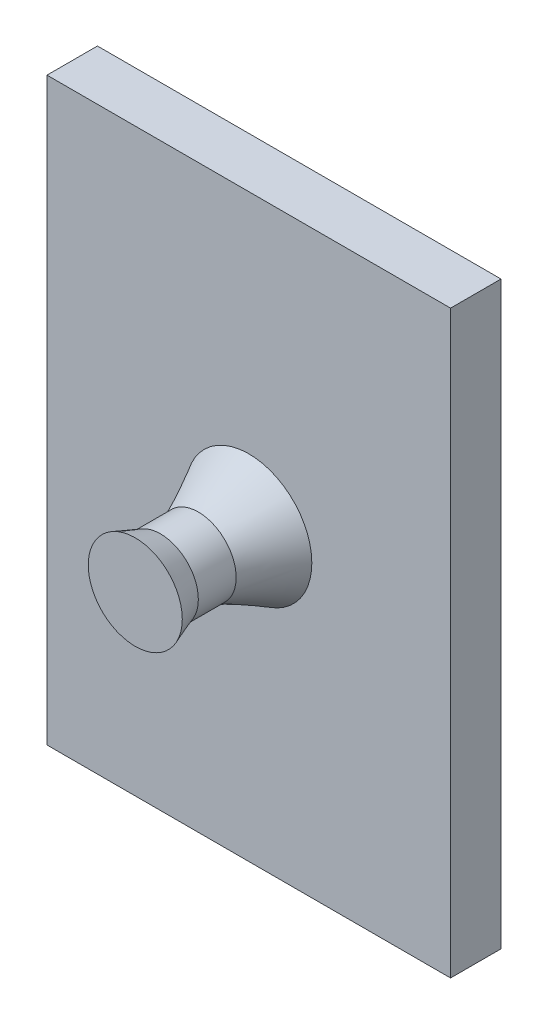
ISO-10303-21;
HEADER;
FILE_DESCRIPTION(('STEP AP214'),'2;1');
FILE_NAME('part.step','',(''),(''),'','','');
FILE_SCHEMA(('AUTOMOTIVE_DESIGN { 1 0 10303 214 1 1 1 1 }'));
ENDSEC;
DATA;
#1=APPLICATION_CONTEXT('core data for automotive mechanical design processes');
#2=APPLICATION_PROTOCOL_DEFINITION('international standard','automotive_design',2000,#1);
#3=PRODUCT_CONTEXT('',#1,'mechanical');
#4=PRODUCT('Part','Part','',(#3));
#5=PRODUCT_RELATED_PRODUCT_CATEGORY('part','',(#4));
#6=PRODUCT_DEFINITION_FORMATION('','',#4);
#7=PRODUCT_DEFINITION_CONTEXT('part definition',#1,'design');
#8=PRODUCT_DEFINITION('design','',#6,#7);
#9=PRODUCT_DEFINITION_SHAPE('','',#8);
#10=(LENGTH_UNIT() NAMED_UNIT(*) SI_UNIT(.MILLI.,.METRE.));
#11=(NAMED_UNIT(*) PLANE_ANGLE_UNIT() SI_UNIT($,.RADIAN.));
#12=(NAMED_UNIT(*) SI_UNIT($,.STERADIAN.) SOLID_ANGLE_UNIT());
#13=UNCERTAINTY_MEASURE_WITH_UNIT(LENGTH_MEASURE(1.E-05),#10,'distance_accuracy_value','');
#14=(GEOMETRIC_REPRESENTATION_CONTEXT(3) GLOBAL_UNCERTAINTY_ASSIGNED_CONTEXT((#13)) GLOBAL_UNIT_ASSIGNED_CONTEXT((#10,
#11,#12)) REPRESENTATION_CONTEXT('',''));
#15=CARTESIAN_POINT('',(0.,0.,0.));
#16=DIRECTION('',(0.,0.,1.));
#17=DIRECTION('',(1.,0.,0.));
#18=AXIS2_PLACEMENT_3D('',#15,#16,#17);
#19=CARTESIAN_POINT('',(0.,0.,2.));
#20=DIRECTION('',(1.,0.,0.));
#21=DIRECTION('',(0.,0.,-1.));
#22=AXIS2_PLACEMENT_3D('',#19,#20,#21);
#23=PLANE('',#22);
#24=DIRECTION('',(0.,-1.,0.));
#25=VECTOR('',#24,1.);
#26=CARTESIAN_POINT('',(0.,0.,0.));
#27=LINE('',#26,#25);
#28=CARTESIAN_POINT('',(0.,23.,0.));
#29=VERTEX_POINT('',#28);
#30=CARTESIAN_POINT('',(0.,0.,0.));
#31=VERTEX_POINT('',#30);
#32=EDGE_CURVE('E119',#29,#31,#27,.T.);
#33=ORIENTED_EDGE('',*,*,#32,.T.);
#34=DIRECTION('',(0.,0.,-1.));
#35=VECTOR('',#34,1.);
#36=CARTESIAN_POINT('',(0.,0.,2.));
#37=LINE('',#36,#35);
#38=CARTESIAN_POINT('',(0.,0.,2.));
#39=VERTEX_POINT('',#38);
#40=EDGE_CURVE('E12',#39,#31,#37,.T.);
#41=ORIENTED_EDGE('',*,*,#40,.F.);
#42=DIRECTION('',(0.,-1.,0.));
#43=VECTOR('',#42,1.);
#44=CARTESIAN_POINT('',(0.,0.,2.));
#45=LINE('',#44,#43);
#46=CARTESIAN_POINT('',(0.,23.,2.));
#47=VERTEX_POINT('',#46);
#48=EDGE_CURVE('E102',#47,#39,#45,.T.);
#49=ORIENTED_EDGE('',*,*,#48,.F.);
#50=DIRECTION('',(0.,0.,-1.));
#51=VECTOR('',#50,1.);
#52=CARTESIAN_POINT('',(0.,23.,2.));
#53=LINE('',#52,#51);
#54=EDGE_CURVE('E115',#47,#29,#53,.T.);
#55=ORIENTED_EDGE('',*,*,#54,.T.);
#56=EDGE_LOOP('',(#33,#41,#49,#55));
#57=FACE_BOUND('',#56,.T.);
#58=ADVANCED_FACE('F47',(#57),#23,.F.);
#59=CARTESIAN_POINT('',(0.,0.,2.));
#60=DIRECTION('',(0.,1.,0.));
#61=DIRECTION('',(0.,0.,1.));
#62=AXIS2_PLACEMENT_3D('',#59,#60,#61);
#63=PLANE('',#62);
#64=DIRECTION('',(1.,0.,0.));
#65=VECTOR('',#64,1.);
#66=CARTESIAN_POINT('',(0.,0.,0.));
#67=LINE('',#66,#65);
#68=CARTESIAN_POINT('',(16.,0.,0.));
#69=VERTEX_POINT('',#68);
#70=EDGE_CURVE('E107',#31,#69,#67,.T.);
#71=ORIENTED_EDGE('',*,*,#70,.T.);
#72=DIRECTION('',(0.,0.,-1.));
#73=VECTOR('',#72,1.);
#74=CARTESIAN_POINT('',(16.,0.,2.));
#75=LINE('',#74,#73);
#76=CARTESIAN_POINT('',(16.,0.,2.));
#77=VERTEX_POINT('',#76);
#78=EDGE_CURVE('E58',#77,#69,#75,.T.);
#79=ORIENTED_EDGE('',*,*,#78,.F.);
#80=DIRECTION('',(1.,0.,0.));
#81=VECTOR('',#80,1.);
#82=CARTESIAN_POINT('',(0.,0.,2.));
#83=LINE('',#82,#81);
#84=EDGE_CURVE('E97',#39,#77,#83,.T.);
#85=ORIENTED_EDGE('',*,*,#84,.F.);
#86=ORIENTED_EDGE('',*,*,#40,.T.);
#87=EDGE_LOOP('',(#71,#79,#85,#86));
#88=FACE_BOUND('',#87,.T.);
#89=ADVANCED_FACE('F106',(#88),#63,.F.);
#90=CARTESIAN_POINT('',(16.,0.,2.));
#91=DIRECTION('',(-1.,0.,0.));
#92=DIRECTION('',(0.,0.,1.));
#93=AXIS2_PLACEMENT_3D('',#90,#91,#92);
#94=PLANE('',#93);
#95=DIRECTION('',(0.,1.,0.));
#96=VECTOR('',#95,1.);
#97=CARTESIAN_POINT('',(16.,0.,0.));
#98=LINE('',#97,#96);
#99=CARTESIAN_POINT('',(16.,23.,0.));
#100=VERTEX_POINT('',#99);
#101=EDGE_CURVE('E84',#69,#100,#98,.T.);
#102=ORIENTED_EDGE('',*,*,#101,.T.);
#103=DIRECTION('',(0.,0.,-1.));
#104=VECTOR('',#103,1.);
#105=CARTESIAN_POINT('',(16.,23.,2.));
#106=LINE('',#105,#104);
#107=CARTESIAN_POINT('',(16.,23.,2.));
#108=VERTEX_POINT('',#107);
#109=EDGE_CURVE('E109',#108,#100,#106,.T.);
#110=ORIENTED_EDGE('',*,*,#109,.F.);
#111=DIRECTION('',(0.,1.,0.));
#112=VECTOR('',#111,1.);
#113=CARTESIAN_POINT('',(16.,0.,2.));
#114=LINE('',#113,#112);
#115=EDGE_CURVE('E100',#77,#108,#114,.T.);
#116=ORIENTED_EDGE('',*,*,#115,.F.);
#117=ORIENTED_EDGE('',*,*,#78,.T.);
#118=EDGE_LOOP('',(#102,#110,#116,#117));
#119=FACE_BOUND('',#118,.T.);
#120=ADVANCED_FACE('F111',(#119),#94,.F.);
#121=CARTESIAN_POINT('',(0.,23.,2.));
#122=DIRECTION('',(0.,-1.,0.));
#123=DIRECTION('',(0.,0.,-1.));
#124=AXIS2_PLACEMENT_3D('',#121,#122,#123);
#125=PLANE('',#124);
#126=DIRECTION('',(-1.,0.,0.));
#127=VECTOR('',#126,1.);
#128=CARTESIAN_POINT('',(0.,23.,0.));
#129=LINE('',#128,#127);
#130=EDGE_CURVE('E90',#100,#29,#129,.T.);
#131=ORIENTED_EDGE('',*,*,#130,.T.);
#132=ORIENTED_EDGE('',*,*,#54,.F.);
#133=DIRECTION('',(-1.,0.,0.));
#134=VECTOR('',#133,1.);
#135=CARTESIAN_POINT('',(0.,23.,2.));
#136=LINE('',#135,#134);
#137=EDGE_CURVE('E67',#108,#47,#136,.T.);
#138=ORIENTED_EDGE('',*,*,#137,.F.);
#139=ORIENTED_EDGE('',*,*,#109,.T.);
#140=EDGE_LOOP('',(#131,#132,#138,#139));
#141=FACE_BOUND('',#140,.T.);
#142=ADVANCED_FACE('F211',(#141),#125,.F.);
#143=CARTESIAN_POINT('',(0.,0.,2.));
#144=DIRECTION('',(0.,0.,-1.));
#145=DIRECTION('',(-1.,0.,0.));
#146=AXIS2_PLACEMENT_3D('',#143,#144,#145);
#147=PLANE('',#146);
#148=CARTESIAN_POINT('',(8.,11.5,2.));
#149=DIRECTION('',(0.,0.,1.));
#150=DIRECTION('',(1.,0.,0.));
#151=AXIS2_PLACEMENT_3D('',#148,#149,#150);
#152=CIRCLE('',#151,2.5);
#153=CARTESIAN_POINT('',(10.5,11.5,2.));
#154=VERTEX_POINT('',#153);
#155=EDGE_CURVE('E172',#154,#154,#152,.T.);
#156=ORIENTED_EDGE('',*,*,#155,.F.);
#157=EDGE_LOOP('',(#156));
#158=FACE_BOUND('',#157,.T.);
#159=ORIENTED_EDGE('',*,*,#48,.T.);
#160=ORIENTED_EDGE('',*,*,#84,.T.);
#161=ORIENTED_EDGE('',*,*,#115,.T.);
#162=ORIENTED_EDGE('',*,*,#137,.T.);
#163=EDGE_LOOP('',(#159,#160,#161,#162));
#164=FACE_BOUND('',#163,.T.);
#165=ADVANCED_FACE('F98',(#158,#164),#147,.F.);
#166=CARTESIAN_POINT('',(0.,0.,0.));
#167=DIRECTION('',(0.,0.,-1.));
#168=DIRECTION('',(-1.,0.,0.));
#169=AXIS2_PLACEMENT_3D('',#166,#167,#168);
#170=PLANE('',#169);
#171=ORIENTED_EDGE('',*,*,#32,.F.);
#172=ORIENTED_EDGE('',*,*,#130,.F.);
#173=ORIENTED_EDGE('',*,*,#101,.F.);
#174=ORIENTED_EDGE('',*,*,#70,.F.);
#175=EDGE_LOOP('',(#171,#172,#173,#174));
#176=FACE_BOUND('',#175,.T.);
#177=ADVANCED_FACE('F158',(#176),#170,.T.);
#178=CARTESIAN_POINT('',(10.5,11.5,2.));
#179=CARTESIAN_POINT('',(9.38218526123225,10.9172788800529,4.));
#180=CARTESIAN_POINT('',(10.5,16.5,2.));
#181=CARTESIAN_POINT('',(10.5476275011263,13.6816494025174,4.));
#182=CARTESIAN_POINT('',(5.5,16.5,2.));
#183=CARTESIAN_POINT('',(7.78325697866185,14.8470916424115,4.));
#184=CARTESIAN_POINT('',(5.5,11.5,2.));
#185=CARTESIAN_POINT('',(6.61781473876775,12.0827211199471,4.));
#186=CARTESIAN_POINT('',(5.5,6.5,2.));
#187=CARTESIAN_POINT('',(5.45237249887365,9.31835059748255,4.));
#188=CARTESIAN_POINT('',(10.5,6.5,2.));
#189=CARTESIAN_POINT('',(8.21674302133815,8.15290835758845,4.));
#190=CARTESIAN_POINT('',(10.5,11.5,2.));
#191=CARTESIAN_POINT('',(9.38218526123225,10.9172788800529,4.));
#192=(BOUNDED_SURFACE() B_SPLINE_SURFACE(3,1,((#178,#179),(#180,#181),(#182,#183),(#184,#185),
(#186,#187),(#188,#189),(#190,#191)),.UNSPECIFIED.,.T.,.F.,.F.) B_SPLINE_SURFACE_WITH_KNOTS((4,
3,4),(2,2),(0.,0.5,1.),(0.,1.),
.UNSPECIFIED.) GEOMETRIC_REPRESENTATION_ITEM() RATIONAL_B_SPLINE_SURFACE(((1.,1.),
(0.333333333333333,0.333333333333333),(0.333333333333333,0.333333333333333),(1.,1.),
(0.333333333333333,0.333333333333333),(0.333333333333333,0.333333333333333),(1.,1.))) REPRESENTATION_ITEM('') SURFACE());
#193=CARTESIAN_POINT('',(8.,11.5,4.));
#194=DIRECTION('',(0.,0.,1.));
#195=DIRECTION('',(1.,0.,0.));
#196=AXIS2_PLACEMENT_3D('',#193,#194,#195);
#197=CIRCLE('',#196,1.5);
#198=CARTESIAN_POINT('',(9.38218526123225,10.9172788800529,4.));
#199=VERTEX_POINT('',#198);
#200=EDGE_CURVE('E50',#199,#199,#197,.T.);
#201=CARTESIAN_POINT('',(10.5,11.5,2.));
#202=CARTESIAN_POINT('',(10.4883560964712,11.4939299883339,2.02083333333333));
#203=CARTESIAN_POINT('',(10.4767121929423,11.4878599766678,2.04166666666667));
#204=CARTESIAN_POINT('',(10.4534243858847,11.4757199533355,2.08333333333333));
#205=CARTESIAN_POINT('',(10.4417804823558,11.4696499416694,2.10416666666667));
#206=CARTESIAN_POINT('',(10.4184926752982,11.4575099183372,2.14583333333333));
#207=CARTESIAN_POINT('',(10.4068487717694,11.4514399066711,2.16666666666667));
#208=CARTESIAN_POINT('',(10.3835609647117,11.4392998833388,2.20833333333333));
#209=CARTESIAN_POINT('',(10.3719170611829,11.4332298716727,2.22916666666667));
#210=CARTESIAN_POINT('',(10.3486292541252,11.4210898483405,2.27083333333333));
#211=CARTESIAN_POINT('',(10.3369853505964,11.4150198366744,2.29166666666667));
#212=CARTESIAN_POINT('',(10.3136975435387,11.4028798133422,2.33333333333333));
#213=CARTESIAN_POINT('',(10.3020536400099,11.396809801676,2.35416666666667));
#214=CARTESIAN_POINT('',(10.2787658329522,11.3846697783438,2.39583333333333));
#215=CARTESIAN_POINT('',(10.2671219294234,11.3785997666777,2.41666666666667));
#216=CARTESIAN_POINT('',(10.2438341223657,11.3664597433455,2.45833333333333));
#217=CARTESIAN_POINT('',(10.2321902188369,11.3603897316794,2.47916666666667));
#218=CARTESIAN_POINT('',(10.2089024117792,11.3482497083471,2.52083333333333));
#219=CARTESIAN_POINT('',(10.1972585082504,11.342179696681,2.54166666666667));
#220=CARTESIAN_POINT('',(10.1739707011927,11.3300396733488,2.58333333333333));
#221=CARTESIAN_POINT('',(10.1623267976639,11.3239696616827,2.60416666666667));
#222=CARTESIAN_POINT('',(10.1390389906062,11.3118296383504,2.64583333333333));
#223=CARTESIAN_POINT('',(10.1273950870774,11.3057596266843,2.66666666666667));
#224=CARTESIAN_POINT('',(10.1041072800198,11.2936196033521,2.70833333333333));
#225=CARTESIAN_POINT('',(10.0924633764909,11.287549591686,2.72916666666667));
#226=CARTESIAN_POINT('',(10.0691755694333,11.2754095683537,2.77083333333333));
#227=CARTESIAN_POINT('',(10.0575316659044,11.2693395566876,2.79166666666667));
#228=CARTESIAN_POINT('',(10.0342438588468,11.2571995333554,2.83333333333333));
#229=CARTESIAN_POINT('',(10.0225999553179,11.2511295216893,2.85416666666667));
#230=CARTESIAN_POINT('',(9.99931214826028,11.238989498357,2.89583333333333));
#231=CARTESIAN_POINT('',(9.98766824473145,11.2329194866909,2.91666666666667));
#232=CARTESIAN_POINT('',(9.96438043767379,11.2207794633587,2.95833333333333));
#233=CARTESIAN_POINT('',(9.95273653414495,11.2147094516926,2.97916666666667));
#234=CARTESIAN_POINT('',(9.92944872708729,11.2025694283604,3.02083333333333));
#235=CARTESIAN_POINT('',(9.91780482355846,11.1964994166942,3.04166666666667));
#236=CARTESIAN_POINT('',(9.8945170165008,11.184359393362,3.08333333333333));
#237=CARTESIAN_POINT('',(9.88287311297197,11.1782893816959,3.10416666666667));
#238=CARTESIAN_POINT('',(9.85958530591431,11.1661493583637,3.14583333333333));
#239=CARTESIAN_POINT('',(9.84794140238548,11.1600793466976,3.16666666666667));
#240=CARTESIAN_POINT('',(9.82465359532782,11.1479393233653,3.20833333333333));
#241=CARTESIAN_POINT('',(9.81300969179899,11.1418693116992,3.22916666666667));
#242=CARTESIAN_POINT('',(9.78972188474133,11.129729288367,3.27083333333333));
#243=CARTESIAN_POINT('',(9.77807798121249,11.1236592767009,3.29166666666667));
#244=CARTESIAN_POINT('',(9.75479017415483,11.1115192533686,3.33333333333333));
#245=CARTESIAN_POINT('',(9.743146270626,11.1054492417025,3.35416666666667));
#246=CARTESIAN_POINT('',(9.71985846356834,11.0933092183703,3.39583333333333));
#247=CARTESIAN_POINT('',(9.70821456003951,11.0872392067042,3.41666666666667));
#248=CARTESIAN_POINT('',(9.68492675298185,11.0750991833719,3.45833333333333));
#249=CARTESIAN_POINT('',(9.67328284945302,11.0690291717058,3.47916666666667));
#250=CARTESIAN_POINT('',(9.64999504239536,11.0568891483736,3.52083333333333));
#251=CARTESIAN_POINT('',(9.63835113886653,11.0508191367075,3.54166666666667));
#252=CARTESIAN_POINT('',(9.61506333180887,11.0386791133753,3.58333333333333));
#253=CARTESIAN_POINT('',(9.60341942828003,11.0326091017091,3.60416666666667));
#254=CARTESIAN_POINT('',(9.58013162122237,11.0204690783769,3.64583333333333));
#255=CARTESIAN_POINT('',(9.56848771769354,11.0143990667108,3.66666666666667));
#256=CARTESIAN_POINT('',(9.54519991063588,11.0022590433786,3.70833333333333));
#257=CARTESIAN_POINT('',(9.53355600710705,10.9961890317124,3.72916666666667));
#258=CARTESIAN_POINT('',(9.51026820004939,10.9840490083802,3.77083333333333));
#259=CARTESIAN_POINT('',(9.49862429652056,10.9779789967141,3.79166666666667));
#260=CARTESIAN_POINT('',(9.4753364894629,10.9658389733819,3.83333333333333));
#261=CARTESIAN_POINT('',(9.46369258593406,10.9597689617158,3.85416666666667));
#262=CARTESIAN_POINT('',(9.4404047788764,10.9476289383835,3.89583333333333));
#263=CARTESIAN_POINT('',(9.42876087534757,10.9415589267174,3.91666666666667));
#264=CARTESIAN_POINT('',(9.40547306828991,10.9294189033852,3.95833333333333));
#265=CARTESIAN_POINT('',(9.39382916476108,10.9233488917191,3.97916666666667));
#266=CARTESIAN_POINT('',(9.38218526123225,10.9172788800529,4.));
#267=B_SPLINE_CURVE_WITH_KNOTS('',3,(#201,#202,#203,#204,#205,#206,#207,#208,#209,#210,#211,
#212,#213,#214,#215,#216,#217,#218,#219,#220,#221,#222,#223,#224,#225,#226,#227,#228,#229,#230,
#231,#232,#233,#234,#235,#236,#237,#238,#239,#240,#241,#242,#243,#244,#245,#246,#247,#248,#249,
#250,#251,#252,#253,#254,#255,#256,#257,#258,#259,#260,#261,#262,#263,#264,#265,#266),
.UNSPECIFIED.,.F.,.F.,(4,2,2,2,2,2,2,2,2,2,2,2,2,2,2,2,2,2,2,2,2,2,2,2,2,2,2,2,2,2,2,2,4),(0.,
0.0738788182034571,0.147757636406914,0.221636454610371,0.295515272813827,0.369394091017284,
0.443272909220741,0.517151727424197,0.591030545627655,0.664909363831111,0.738788182034568,
0.812667000238025,0.886545818441481,0.960424636644938,1.0343034548484,1.10818227305185,
1.18206109125531,1.25593990945877,1.32981872766222,1.40369754586568,1.47757636406914,
1.55145518227259,1.62533400047605,1.69921281867951,1.77309163688296,1.84697045508642,
1.92084927328988,1.99472809149333,2.06860690969679,2.14248572790025,2.2163645461037,
2.29024336430716,2.36412218251062),.UNSPECIFIED.);
#268=EDGE_CURVE('BSEAM150',#154,#199,#267,.T.);
#269=ORIENTED_EDGE('',*,*,#155,.T.);
#270=ORIENTED_EDGE('',*,*,#200,.F.);
#271=ORIENTED_EDGE('',*,*,#268,.T.);
#272=ORIENTED_EDGE('',*,*,#268,.F.);
#273=EDGE_LOOP('',(#269,#271,#270,#272));
#274=FACE_BOUND('',#273,.T.);
#275=ADVANCED_FACE('F150',(#274),#192,.T.);
#276=CARTESIAN_POINT('',(8.,11.5,5.5));
#277=DIRECTION('',(0.,0.,-1.));
#278=DIRECTION('',(-1.,0.,0.));
#279=AXIS2_PLACEMENT_3D('',#276,#277,#278);
#280=CYLINDRICAL_SURFACE('',#279,1.5);
#281=CARTESIAN_POINT('',(8.,11.5,5.5));
#282=DIRECTION('',(0.,0.,1.));
#283=DIRECTION('',(1.,0.,0.));
#284=AXIS2_PLACEMENT_3D('',#281,#282,#283);
#285=CIRCLE('',#284,1.5);
#286=CARTESIAN_POINT('',(9.5,11.5,5.5));
#287=VERTEX_POINT('',#286);
#288=EDGE_CURVE('E180',#287,#287,#285,.T.);
#289=ORIENTED_EDGE('',*,*,#288,.F.);
#290=EDGE_LOOP('',(#289));
#291=FACE_BOUND('',#290,.T.);
#292=ORIENTED_EDGE('',*,*,#200,.T.);
#293=EDGE_LOOP('',(#292));
#294=FACE_BOUND('',#293,.T.);
#295=ADVANCED_FACE('F139',(#291,#294),#280,.T.);
#296=CARTESIAN_POINT('',(8.,11.5,5.5));
#297=DIRECTION('',(0.,0.,1.));
#298=DIRECTION('',(1.,0.,0.));
#299=AXIS2_PLACEMENT_3D('',#296,#297,#298);
#300=CONICAL_SURFACE('',#299,1.5,0.349065850398867);
#301=CARTESIAN_POINT('',(8.,11.5,6.5));
#302=DIRECTION('',(0.,0.,1.));
#303=DIRECTION('',(1.,0.,0.));
#304=AXIS2_PLACEMENT_3D('',#301,#302,#303);
#305=CIRCLE('',#304,1.8639702342662);
#306=CARTESIAN_POINT('',(9.8639702342662,11.5,6.5));
#307=VERTEX_POINT('',#306);
#308=EDGE_CURVE('E187',#307,#307,#305,.T.);
#309=ORIENTED_EDGE('',*,*,#308,.F.);
#310=EDGE_LOOP('',(#309));
#311=FACE_BOUND('',#310,.T.);
#312=ORIENTED_EDGE('',*,*,#288,.T.);
#313=EDGE_LOOP('',(#312));
#314=FACE_BOUND('',#313,.T.);
#315=ADVANCED_FACE('F149',(#311,#314),#300,.T.);
#316=CARTESIAN_POINT('',(8.,11.5,6.5));
#317=DIRECTION('',(0.,0.,1.));
#318=DIRECTION('',(1.,0.,0.));
#319=AXIS2_PLACEMENT_3D('',#316,#317,#318);
#320=PLANE('',#319);
#321=ORIENTED_EDGE('',*,*,#308,.T.);
#322=EDGE_LOOP('',(#321));
#323=FACE_BOUND('',#322,.T.);
#324=ADVANCED_FACE('F192',(#323),#320,.T.);
#325=CLOSED_SHELL('',(#58,#89,#120,#142,#165,#177,#275,#295,#315,#324));
#326=MANIFOLD_SOLID_BREP('B2',#325);
#327=ADVANCED_BREP_SHAPE_REPRESENTATION('',(#18,#326),#14);
#328=SHAPE_DEFINITION_REPRESENTATION(#9,#327);
ENDSEC;
END-ISO-10303-21;
